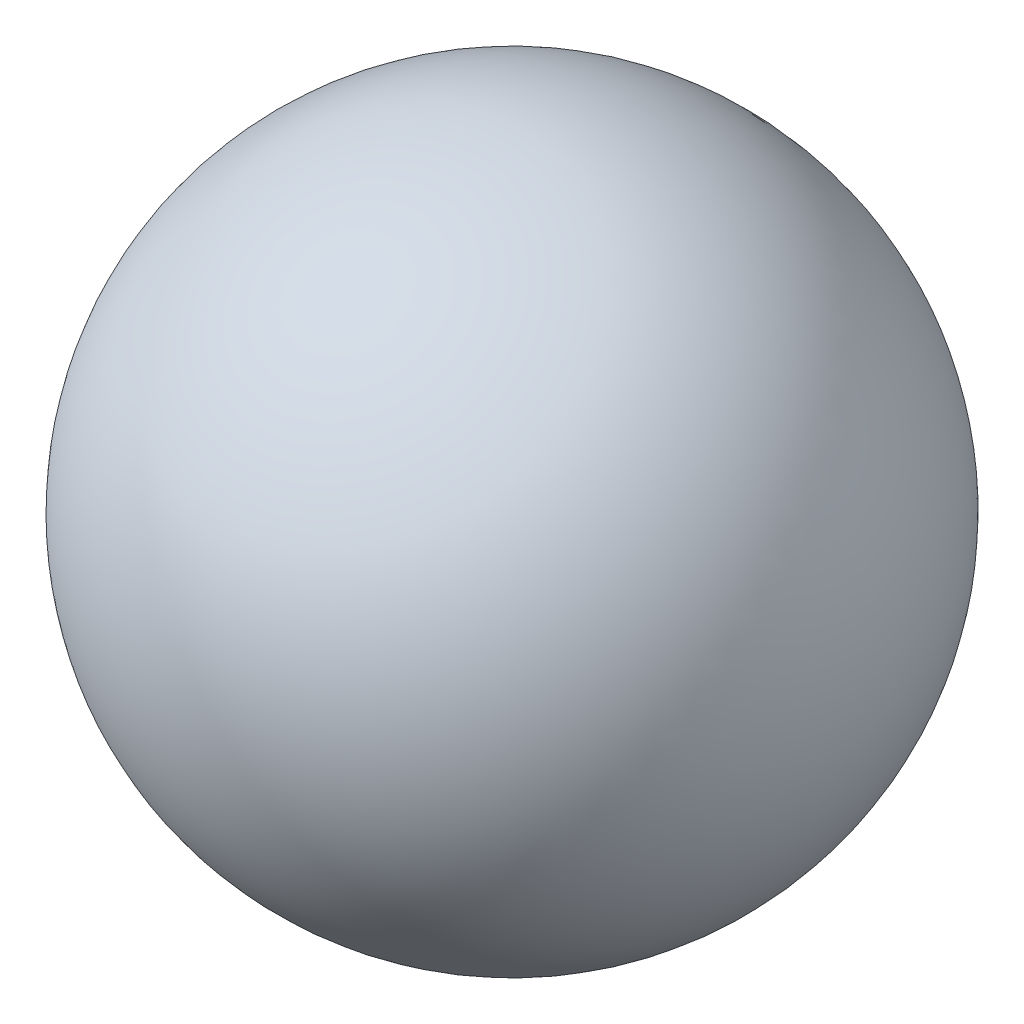
ISO-10303-21;
HEADER;
FILE_DESCRIPTION(('STEP AP214'),'2;1');
FILE_NAME('part.step','',(''),(''),'','','');
FILE_SCHEMA(('AUTOMOTIVE_DESIGN { 1 0 10303 214 1 1 1 1 }'));
ENDSEC;
DATA;
#1=APPLICATION_CONTEXT('core data for automotive mechanical design processes');
#2=APPLICATION_PROTOCOL_DEFINITION('international standard','automotive_design',2000,#1);
#3=PRODUCT_CONTEXT('',#1,'mechanical');
#4=PRODUCT('Part','Part','',(#3));
#5=PRODUCT_RELATED_PRODUCT_CATEGORY('part','',(#4));
#6=PRODUCT_DEFINITION_FORMATION('','',#4);
#7=PRODUCT_DEFINITION_CONTEXT('part definition',#1,'design');
#8=PRODUCT_DEFINITION('design','',#6,#7);
#9=PRODUCT_DEFINITION_SHAPE('','',#8);
#10=(LENGTH_UNIT() NAMED_UNIT(*) SI_UNIT(.MILLI.,.METRE.));
#11=(NAMED_UNIT(*) PLANE_ANGLE_UNIT() SI_UNIT($,.RADIAN.));
#12=(NAMED_UNIT(*) SI_UNIT($,.STERADIAN.) SOLID_ANGLE_UNIT());
#13=UNCERTAINTY_MEASURE_WITH_UNIT(LENGTH_MEASURE(1.E-05),#10,'distance_accuracy_value','');
#14=(GEOMETRIC_REPRESENTATION_CONTEXT(3) GLOBAL_UNCERTAINTY_ASSIGNED_CONTEXT((#13)) GLOBAL_UNIT_ASSIGNED_CONTEXT((#10,
#11,#12)) REPRESENTATION_CONTEXT('',''));
#15=CARTESIAN_POINT('',(0.,0.,0.));
#16=DIRECTION('',(0.,0.,1.));
#17=DIRECTION('',(1.,0.,0.));
#18=AXIS2_PLACEMENT_3D('',#15,#16,#17);
#19=CARTESIAN_POINT('',(64.16,-18.1355759759196,-66.9709009422872));
#20=DIRECTION('',(0.,-0.261383566232645,-0.965235013508889));
#21=DIRECTION('',(0.173648177666933,0.950570924782397,-0.257412562535889));
#22=AXIS2_PLACEMENT_3D('',#19,#20,#21);
#23=SPHERICAL_SURFACE('',#22,7.15);
#24=CARTESIAN_POINT('',(64.16,-16.2666834773562,-60.0694705956986));
#25=VERTEX_POINT('',#24);
#26=VERTEX_LOOP('',#25);
#27=FACE_BOUND('',#26,.T.);
#28=CARTESIAN_POINT('',(64.16,-20.004468474483,-73.8723312888757));
#29=VERTEX_POINT('',#28);
#30=VERTEX_LOOP('',#29);
#31=FACE_BOUND('',#30,.T.);
#32=ADVANCED_FACE('F16',(#27,#31),#23,.T.);
#33=CLOSED_SHELL('',(#32));
#34=MANIFOLD_SOLID_BREP('B1',#33);
#35=ADVANCED_BREP_SHAPE_REPRESENTATION('',(#18,#34),#14);
#36=SHAPE_DEFINITION_REPRESENTATION(#9,#35);
ENDSEC;
END-ISO-10303-21;
